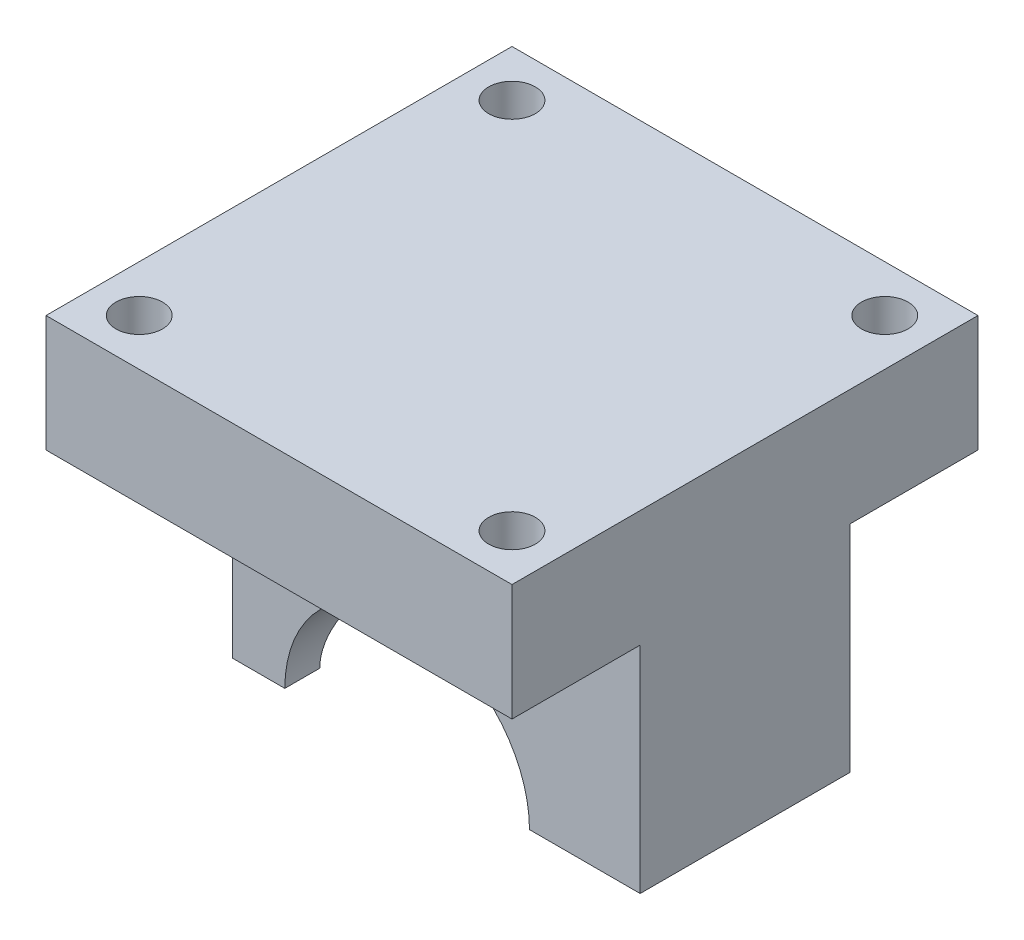
ISO-10303-21;
HEADER;
FILE_DESCRIPTION(('STEP AP214'),'2;1');
FILE_NAME('part.step','',(''),(''),'','','');
FILE_SCHEMA(('AUTOMOTIVE_DESIGN { 1 0 10303 214 1 1 1 1 }'));
ENDSEC;
DATA;
#1=APPLICATION_CONTEXT('core data for automotive mechanical design processes');
#2=APPLICATION_PROTOCOL_DEFINITION('international standard','automotive_design',2000,#1);
#3=PRODUCT_CONTEXT('',#1,'mechanical');
#4=PRODUCT('Part','Part','',(#3));
#5=PRODUCT_RELATED_PRODUCT_CATEGORY('part','',(#4));
#6=PRODUCT_DEFINITION_FORMATION('','',#4);
#7=PRODUCT_DEFINITION_CONTEXT('part definition',#1,'design');
#8=PRODUCT_DEFINITION('design','',#6,#7);
#9=PRODUCT_DEFINITION_SHAPE('','',#8);
#10=(LENGTH_UNIT() NAMED_UNIT(*) SI_UNIT(.MILLI.,.METRE.));
#11=(NAMED_UNIT(*) PLANE_ANGLE_UNIT() SI_UNIT($,.RADIAN.));
#12=(NAMED_UNIT(*) SI_UNIT($,.STERADIAN.) SOLID_ANGLE_UNIT());
#13=UNCERTAINTY_MEASURE_WITH_UNIT(LENGTH_MEASURE(1.E-05),#10,'distance_accuracy_value','');
#14=(GEOMETRIC_REPRESENTATION_CONTEXT(3) GLOBAL_UNCERTAINTY_ASSIGNED_CONTEXT((#13)) GLOBAL_UNIT_ASSIGNED_CONTEXT((#10,
#11,#12)) REPRESENTATION_CONTEXT('',''));
#15=CARTESIAN_POINT('',(0.,0.,0.));
#16=DIRECTION('',(0.,0.,1.));
#17=DIRECTION('',(1.,0.,0.));
#18=AXIS2_PLACEMENT_3D('',#15,#16,#17);
#19=CARTESIAN_POINT('',(0.,0.,0.));
#20=DIRECTION('',(0.,-1.,0.));
#21=DIRECTION('',(0.,0.,-1.));
#22=AXIS2_PLACEMENT_3D('',#19,#20,#21);
#23=PLANE('',#22);
#24=DIRECTION('',(0.,0.,1.));
#25=VECTOR('',#24,1.);
#26=CARTESIAN_POINT('',(-15.,0.,9.));
#27=LINE('',#26,#25);
#28=CARTESIAN_POINT('',(-15.,0.,6.));
#29=VERTEX_POINT('',#28);
#30=CARTESIAN_POINT('',(-15.,0.,9.));
#31=VERTEX_POINT('',#30);
#32=EDGE_CURVE('E228',#29,#31,#27,.T.);
#33=ORIENTED_EDGE('',*,*,#32,.F.);
#34=DIRECTION('',(-1.,0.,0.));
#35=VECTOR('',#34,1.);
#36=CARTESIAN_POINT('',(20.001,0.,6.));
#37=LINE('',#36,#35);
#38=CARTESIAN_POINT('',(-10.5,0.,6.));
#39=VERTEX_POINT('',#38);
#40=EDGE_CURVE('E232',#29,#39,#37,.F.);
#41=ORIENTED_EDGE('',*,*,#40,.T.);
#42=DIRECTION('',(0.,0.,1.));
#43=VECTOR('',#42,1.);
#44=CARTESIAN_POINT('',(-10.5,0.,-9.001));
#45=LINE('',#44,#43);
#46=CARTESIAN_POINT('',(-10.5,0.,9.));
#47=VERTEX_POINT('',#46);
#48=EDGE_CURVE('E241',#39,#47,#45,.T.);
#49=ORIENTED_EDGE('',*,*,#48,.T.);
#50=DIRECTION('',(1.,0.,0.));
#51=VECTOR('',#50,1.);
#52=CARTESIAN_POINT('',(-20.,0.,9.));
#53=LINE('',#52,#51);
#54=EDGE_CURVE('E209',#31,#47,#53,.T.);
#55=ORIENTED_EDGE('',*,*,#54,.F.);
#56=EDGE_LOOP('',(#33,#41,#49,#55));
#57=FACE_BOUND('',#56,.T.);
#58=ADVANCED_FACE('F33',(#57),#23,.T.);
#59=DIRECTION('',(0.,0.,1.));
#60=VECTOR('',#59,1.);
#61=CARTESIAN_POINT('',(10.5,0.,-9.001));
#62=LINE('',#61,#60);
#63=CARTESIAN_POINT('',(10.5,0.,9.));
#64=VERTEX_POINT('',#63);
#65=CARTESIAN_POINT('',(10.5,0.,-9.));
#66=VERTEX_POINT('',#65);
#67=EDGE_CURVE('E303',#64,#66,#62,.F.);
#68=ORIENTED_EDGE('',*,*,#67,.T.);
#69=DIRECTION('',(-1.,0.,0.));
#70=VECTOR('',#69,1.);
#71=CARTESIAN_POINT('',(-20.,0.,-9.));
#72=LINE('',#71,#70);
#73=CARTESIAN_POINT('',(20.,0.,-9.));
#74=VERTEX_POINT('',#73);
#75=EDGE_CURVE('E198',#74,#66,#72,.T.);
#76=ORIENTED_EDGE('',*,*,#75,.F.);
#77=DIRECTION('',(0.,0.,-1.));
#78=VECTOR('',#77,1.);
#79=CARTESIAN_POINT('',(20.,0.,9.));
#80=LINE('',#79,#78);
#81=CARTESIAN_POINT('',(20.,0.,9.));
#82=VERTEX_POINT('',#81);
#83=EDGE_CURVE('E189',#82,#74,#80,.T.);
#84=ORIENTED_EDGE('',*,*,#83,.F.);
#85=EDGE_CURVE('E196',#64,#82,#53,.T.);
#86=ORIENTED_EDGE('',*,*,#85,.F.);
#87=EDGE_LOOP('',(#68,#76,#84,#86));
#88=FACE_BOUND('',#87,.T.);
#89=ADVANCED_FACE('F195',(#88),#23,.T.);
#90=CARTESIAN_POINT('',(20.,18.47,9.));
#91=DIRECTION('',(-1.,0.,0.));
#92=DIRECTION('',(0.,0.,1.));
#93=AXIS2_PLACEMENT_3D('',#90,#91,#92);
#94=PLANE('',#93);
#95=ORIENTED_EDGE('',*,*,#83,.T.);
#96=DIRECTION('',(0.,-1.,0.));
#97=VECTOR('',#96,1.);
#98=CARTESIAN_POINT('',(20.,18.47,-9.));
#99=LINE('',#98,#97);
#100=CARTESIAN_POINT('',(20.,18.47,-9.));
#101=VERTEX_POINT('',#100);
#102=EDGE_CURVE('E11',#101,#74,#99,.T.);
#103=ORIENTED_EDGE('',*,*,#102,.F.);
#104=DIRECTION('',(0.,0.,-1.));
#105=VECTOR('',#104,1.);
#106=CARTESIAN_POINT('',(20.,18.47,20.));
#107=LINE('',#106,#105);
#108=CARTESIAN_POINT('',(20.,18.47,-20.));
#109=VERTEX_POINT('',#108);
#110=EDGE_CURVE('E148',#101,#109,#107,.T.);
#111=ORIENTED_EDGE('',*,*,#110,.T.);
#112=DIRECTION('',(0.,-1.,0.));
#113=VECTOR('',#112,1.);
#114=CARTESIAN_POINT('',(20.,28.47,-20.));
#115=LINE('',#114,#113);
#116=CARTESIAN_POINT('',(20.,28.47,-20.));
#117=VERTEX_POINT('',#116);
#118=EDGE_CURVE('E128',#117,#109,#115,.T.);
#119=ORIENTED_EDGE('',*,*,#118,.F.);
#120=DIRECTION('',(0.,0.,-1.));
#121=VECTOR('',#120,1.);
#122=CARTESIAN_POINT('',(20.,28.47,20.));
#123=LINE('',#122,#121);
#124=CARTESIAN_POINT('',(20.,28.47,20.));
#125=VERTEX_POINT('',#124);
#126=EDGE_CURVE('E134',#125,#117,#123,.T.);
#127=ORIENTED_EDGE('',*,*,#126,.F.);
#128=DIRECTION('',(0.,-1.,0.));
#129=VECTOR('',#128,1.);
#130=CARTESIAN_POINT('',(20.,28.47,20.));
#131=LINE('',#130,#129);
#132=CARTESIAN_POINT('',(20.,18.47,20.));
#133=VERTEX_POINT('',#132);
#134=EDGE_CURVE('E172',#125,#133,#131,.T.);
#135=ORIENTED_EDGE('',*,*,#134,.T.);
#136=CARTESIAN_POINT('',(20.,18.47,9.));
#137=VERTEX_POINT('',#136);
#138=EDGE_CURVE('E158',#133,#137,#107,.T.);
#139=ORIENTED_EDGE('',*,*,#138,.T.);
#140=DIRECTION('',(0.,-1.,0.));
#141=VECTOR('',#140,1.);
#142=CARTESIAN_POINT('',(20.,18.47,9.));
#143=LINE('',#142,#141);
#144=EDGE_CURVE('E42',#137,#82,#143,.T.);
#145=ORIENTED_EDGE('',*,*,#144,.T.);
#146=EDGE_LOOP('',(#95,#103,#111,#119,#127,#135,#139,#145));
#147=FACE_BOUND('',#146,.T.);
#148=ADVANCED_FACE('F35',(#147),#94,.F.);
#149=CARTESIAN_POINT('',(-20.,18.47,-9.));
#150=DIRECTION('',(0.,0.,1.));
#151=DIRECTION('',(1.,0.,0.));
#152=AXIS2_PLACEMENT_3D('',#149,#150,#151);
#153=PLANE('',#152);
#154=CARTESIAN_POINT('',(-10.5,0.,-9.));
#155=VERTEX_POINT('',#154);
#156=CARTESIAN_POINT('',(-15.,0.,-9.));
#157=VERTEX_POINT('',#156);
#158=EDGE_CURVE('E199',#155,#157,#72,.T.);
#159=ORIENTED_EDGE('',*,*,#158,.T.);
#160=DIRECTION('',(0.,-1.,0.));
#161=VECTOR('',#160,1.);
#162=CARTESIAN_POINT('',(-15.,18.471,-9.));
#163=LINE('',#162,#161);
#164=CARTESIAN_POINT('',(-15.,18.47,-9.));
#165=VERTEX_POINT('',#164);
#166=EDGE_CURVE('E221',#165,#157,#163,.T.);
#167=ORIENTED_EDGE('',*,*,#166,.F.);
#168=DIRECTION('',(-1.,0.,0.));
#169=VECTOR('',#168,1.);
#170=CARTESIAN_POINT('',(-20.,18.47,-9.));
#171=LINE('',#170,#169);
#172=EDGE_CURVE('E210',#101,#165,#171,.T.);
#173=ORIENTED_EDGE('',*,*,#172,.F.);
#174=ORIENTED_EDGE('',*,*,#102,.T.);
#175=ORIENTED_EDGE('',*,*,#75,.T.);
#176=CARTESIAN_POINT('',(0.,0.,-9.));
#177=DIRECTION('',(0.,0.,1.));
#178=DIRECTION('',(1.,0.,0.));
#179=AXIS2_PLACEMENT_3D('',#176,#177,#178);
#180=CIRCLE('',#179,10.5);
#181=EDGE_CURVE('E200',#155,#66,#180,.F.);
#182=ORIENTED_EDGE('',*,*,#181,.F.);
#183=EDGE_LOOP('',(#159,#167,#173,#174,#175,#182));
#184=FACE_BOUND('',#183,.T.);
#185=ADVANCED_FACE('F220',(#184),#153,.F.);
#186=CARTESIAN_POINT('',(-20.,18.47,9.));
#187=DIRECTION('',(0.,0.,-1.));
#188=DIRECTION('',(-1.,0.,0.));
#189=AXIS2_PLACEMENT_3D('',#186,#187,#188);
#190=PLANE('',#189);
#191=DIRECTION('',(1.,0.,0.));
#192=VECTOR('',#191,1.);
#193=CARTESIAN_POINT('',(-20.,18.47,9.));
#194=LINE('',#193,#192);
#195=CARTESIAN_POINT('',(-15.,18.47,9.));
#196=VERTEX_POINT('',#195);
#197=EDGE_CURVE('E186',#196,#137,#194,.T.);
#198=ORIENTED_EDGE('',*,*,#197,.F.);
#199=DIRECTION('',(0.,-1.,0.));
#200=VECTOR('',#199,1.);
#201=CARTESIAN_POINT('',(-15.,18.471,9.));
#202=LINE('',#201,#200);
#203=EDGE_CURVE('E224',#196,#31,#202,.T.);
#204=ORIENTED_EDGE('',*,*,#203,.T.);
#205=ORIENTED_EDGE('',*,*,#54,.T.);
#206=CARTESIAN_POINT('',(0.,0.,9.));
#207=DIRECTION('',(0.,0.,1.));
#208=DIRECTION('',(1.,0.,0.));
#209=AXIS2_PLACEMENT_3D('',#206,#207,#208);
#210=CIRCLE('',#209,10.5);
#211=EDGE_CURVE('E204',#64,#47,#210,.T.);
#212=ORIENTED_EDGE('',*,*,#211,.F.);
#213=ORIENTED_EDGE('',*,*,#85,.T.);
#214=ORIENTED_EDGE('',*,*,#144,.F.);
#215=EDGE_LOOP('',(#198,#204,#205,#212,#213,#214));
#216=FACE_BOUND('',#215,.T.);
#217=ADVANCED_FACE('F295',(#216),#190,.F.);
#218=CARTESIAN_POINT('',(-15.,0.,-6.));
#219=VERTEX_POINT('',#218);
#220=EDGE_CURVE('E49',#157,#219,#27,.T.);
#221=ORIENTED_EDGE('',*,*,#220,.F.);
#222=ORIENTED_EDGE('',*,*,#158,.F.);
#223=CARTESIAN_POINT('',(-10.5,0.,-6.));
#224=VERTEX_POINT('',#223);
#225=EDGE_CURVE('E242',#155,#224,#45,.T.);
#226=ORIENTED_EDGE('',*,*,#225,.T.);
#227=DIRECTION('',(-1.,0.,0.));
#228=VECTOR('',#227,1.);
#229=CARTESIAN_POINT('',(20.001,0.,-6.));
#230=LINE('',#229,#228);
#231=EDGE_CURVE('E56',#224,#219,#230,.T.);
#232=ORIENTED_EDGE('',*,*,#231,.T.);
#233=EDGE_LOOP('',(#221,#222,#226,#232));
#234=FACE_BOUND('',#233,.T.);
#235=ADVANCED_FACE('F287',(#234),#23,.T.);
#236=CARTESIAN_POINT('',(0.,0.,-9.001));
#237=DIRECTION('',(0.,0.,1.));
#238=DIRECTION('',(1.,0.,0.));
#239=AXIS2_PLACEMENT_3D('',#236,#237,#238);
#240=CYLINDRICAL_SURFACE('',#239,10.5);
#241=ORIENTED_EDGE('',*,*,#48,.F.);
#242=CARTESIAN_POINT('',(-10.5,0.,-6.));
#243=CARTESIAN_POINT('',(-10.5000312323171,0.155502925143123,-6.00002868326071));
#244=CARTESIAN_POINT('',(-10.4965467619336,0.310989459605455,-5.9939560372494));
#245=CARTESIAN_POINT('',(-10.4827773380282,0.620654508223242,-5.96982428552888));
#246=CARTESIAN_POINT('',(-10.472495621128,0.774833609562622,-5.95177088463915));
#247=CARTESIAN_POINT('',(-10.4454333996789,1.07995629913026,-5.9040190415042));
#248=CARTESIAN_POINT('',(-10.4286872742641,1.23091261863768,-5.87438219231843));
#249=CARTESIAN_POINT('',(-10.3891154411449,1.52935731424097,-5.80384155522881));
#250=CARTESIAN_POINT('',(-10.3662892642791,1.67684542175931,-5.76293689784672));
#251=CARTESIAN_POINT('',(-10.3151366966868,1.96713870302777,-5.67040818495836));
#252=CARTESIAN_POINT('',(-10.2868201926486,2.10995176296317,-5.6188033862729));
#253=CARTESIAN_POINT('',(-10.2252973118242,2.39038550341413,-5.50535790834433));
#254=CARTESIAN_POINT('',(-10.1920890817453,2.5280041910418,-5.44351334853124));
#255=CARTESIAN_POINT('',(-10.0861193920345,2.93216830627208,-5.24334940394797));
#256=CARTESIAN_POINT('',(-10.0070202984068,3.1899816733811,-5.09041269971699));
#257=CARTESIAN_POINT('',(-9.83222574184396,3.69512383646307,-4.73790322568543));
#258=CARTESIAN_POINT('',(-9.7357476069095,3.94038133658734,-4.53577592438749));
#259=CARTESIAN_POINT('',(-9.53892202787594,4.39551157162937,-4.09630897576221));
#260=CARTESIAN_POINT('',(-9.43857081219306,4.60534868869554,-3.85893433002525));
#261=CARTESIAN_POINT('',(-9.23241829705254,5.00686738849591,-3.32482825851804));
#262=CARTESIAN_POINT('',(-9.1272116275037,5.19409089283758,-3.02444886551071));
#263=CARTESIAN_POINT('',(-8.98479353337835,5.43435387829326,-2.54937929896771));
#264=CARTESIAN_POINT('',(-8.93989050301715,5.50767329511113,-2.38695977929524));
#265=CARTESIAN_POINT('',(-8.85696777871921,5.64005451406595,-2.05468008989987));
#266=CARTESIAN_POINT('',(-8.81894582704675,5.69912099483071,-1.88482238350506));
#267=CARTESIAN_POINT('',(-8.75900479298559,5.79069350293105,-1.57722146865764));
#268=CARTESIAN_POINT('',(-8.73538420623737,5.82618464662098,-1.44068900951035));
#269=CARTESIAN_POINT('',(-8.69411873649479,5.88758618847257,-1.16460806153307));
#270=CARTESIAN_POINT('',(-8.67647258151584,5.91349862609376,-1.02506022143096));
#271=CARTESIAN_POINT('',(-8.64776851771148,5.95539645016538,-0.743930927036742));
#272=CARTESIAN_POINT('',(-8.63670492774402,5.97139039736415,-0.602351334677315));
#273=CARTESIAN_POINT('',(-8.62154261003826,5.99326137071358,-0.318033404753159));
#274=CARTESIAN_POINT('',(-8.61744402127387,5.99913819499552,-0.175295044124418));
#275=CARTESIAN_POINT('',(-8.61636587961779,6.00068664959584,0.110458829006182));
#276=CARTESIAN_POINT('',(-8.61939601081516,5.99634439769363,0.253474454509471));
#277=CARTESIAN_POINT('',(-8.63248014050462,5.97749246711862,0.538504544520632));
#278=CARTESIAN_POINT('',(-8.64253416674081,5.96298274828477,0.680519005071708));
#279=CARTESIAN_POINT('',(-8.66930589933352,5.92399304566501,0.962589777827786));
#280=CARTESIAN_POINT('',(-8.68602610500563,5.89950932230301,1.10264533518271));
#281=CARTESIAN_POINT('',(-8.72554694173816,5.84089629409534,1.37986871062944));
#282=CARTESIAN_POINT('',(-8.74835002778777,5.80676309448519,1.51703533860869));
#283=CARTESIAN_POINT('',(-8.82460229177655,5.69078084989655,1.92183102381229));
#284=CARTESIAN_POINT('',(-8.88603904603347,5.59515083407102,2.184154118654));
#285=CARTESIAN_POINT('',(-9.02357537045335,5.37050972239288,2.6896830519722));
#286=CARTESIAN_POINT('',(-9.09968079043222,5.24148530189929,2.93288120882267));
#287=CARTESIAN_POINT('',(-9.27278901621917,4.92970041368248,3.43491779845721));
#288=CARTESIAN_POINT('',(-9.37118647785558,4.74164295800828,3.69002155625297));
#289=CARTESIAN_POINT('',(-9.51963407244217,4.43167932701314,4.04786482987679));
#290=CARTESIAN_POINT('',(-9.569298391235,4.3236146907551,4.16309237053519));
#291=CARTESIAN_POINT('',(-9.66784979801288,4.09850674859315,4.38488226998758));
#292=CARTESIAN_POINT('',(-9.71673675848215,3.98146198758747,4.49144321869622));
#293=CARTESIAN_POINT('',(-9.81815731565572,3.72490802201013,4.70704547522145));
#294=CARTESIAN_POINT('',(-9.87046404907576,3.58436314547206,4.81496363613988));
#295=CARTESIAN_POINT('',(-9.97131462894593,3.29341403182272,5.01845800180585));
#296=CARTESIAN_POINT('',(-10.0198599947089,3.14301382132218,5.11403920026658));
#297=CARTESIAN_POINT('',(-10.111798359052,2.83330042558111,5.29190468197646));
#298=CARTESIAN_POINT('',(-10.1551977262947,2.67399862404779,5.37420544755071));
#299=CARTESIAN_POINT('',(-10.2356204791023,2.34740884183261,5.52466913121936));
#300=CARTESIAN_POINT('',(-10.272647735488,2.18012578891822,5.59284063749481));
#301=CARTESIAN_POINT('',(-10.3368535242973,1.85083055260308,5.70988272169392));
#302=CARTESIAN_POINT('',(-10.364543416916,1.68928242275379,5.75977740504482));
#303=CARTESIAN_POINT('',(-10.4126648623234,1.36155617090495,5.84592739375965));
#304=CARTESIAN_POINT('',(-10.433097691071,1.19537886836698,5.88218509688455));
#305=CARTESIAN_POINT('',(-10.4662149385246,0.85857650246765,5.94072776248758));
#306=CARTESIAN_POINT('',(-10.4788444595665,0.687928538185176,5.96291375628162));
#307=CARTESIAN_POINT('',(-10.4915160033629,0.430685549197037,5.98514324040381));
#308=CARTESIAN_POINT('',(-10.4946944134647,0.344680981066985,5.99071150065149));
#309=CARTESIAN_POINT('',(-10.4989372292922,0.172455798337681,5.99814038563698));
#310=CARTESIAN_POINT('',(-10.5000015336611,0.0862351735784179,6.00000083261077));
#311=CARTESIAN_POINT('',(-10.5,0.,6.));
#312=B_SPLINE_CURVE_WITH_KNOTS('',3,(#242,#243,#244,#245,#246,#247,#248,#249,#250,#251,#252,
#253,#254,#255,#256,#257,#258,#259,#260,#261,#262,#263,#264,#265,#266,#267,#268,#269,#270,#271,
#272,#273,#274,#275,#276,#277,#278,#279,#280,#281,#282,#283,#284,#285,#286,#287,#288,#289,#290,
#291,#292,#293,#294,#295,#296,#297,#298,#299,#300,#301,#302,#303,#304,#305,#306,#307,#308,#309,
#310,#311),.UNSPECIFIED.,.F.,.F.,(4,2,2,2,2,2,2,2,2,2,2,2,2,2,2,2,2,2,2,2,2,2,2,2,2,2,2,2,2,2,2,
2,2,2,4),(0.,0.466325450821407,0.932429012825639,1.39608714609375,1.85978106747844,
2.32264762110014,2.78568999079645,3.71190164616867,4.70440865553539,5.69790783519077,
6.79948138478367,7.35013944891105,7.90061650895936,8.32928412961428,8.75786042744241,
9.18606630005451,9.61428071663408,10.0430771816857,10.4718753404744,10.9008344177125,
11.3299668811251,12.1840218241832,13.0384180689222,14.0296721281382,14.526090368468,
15.0225892169002,15.5761655870355,16.1295171749984,16.6821766273884,17.2344991654586,
17.7477562391189,18.260923025654,18.7776601070629,19.0362978380061,19.2949479685426),.UNSPECIFIED.);
#313=EDGE_CURVE('E234',#224,#39,#312,.T.);
#314=ORIENTED_EDGE('',*,*,#313,.F.);
#315=ORIENTED_EDGE('',*,*,#225,.F.);
#316=ORIENTED_EDGE('',*,*,#181,.T.);
#317=ORIENTED_EDGE('',*,*,#67,.F.);
#318=ORIENTED_EDGE('',*,*,#211,.T.);
#319=EDGE_LOOP('',(#241,#314,#315,#316,#317,#318));
#320=FACE_BOUND('',#319,.T.);
#321=ADVANCED_FACE('F294',(#320),#240,.F.);
#322=CARTESIAN_POINT('',(20.001,0.,0.));
#323=DIRECTION('',(-1.,0.,0.));
#324=DIRECTION('',(0.,0.,1.));
#325=AXIS2_PLACEMENT_3D('',#322,#323,#324);
#326=CYLINDRICAL_SURFACE('',#325,6.);
#327=ORIENTED_EDGE('',*,*,#40,.F.);
#328=CARTESIAN_POINT('',(-15.,0.,0.));
#329=DIRECTION('',(1.,0.,0.));
#330=DIRECTION('',(0.,0.,-1.));
#331=AXIS2_PLACEMENT_3D('',#328,#329,#330);
#332=CIRCLE('',#331,6.);
#333=EDGE_CURVE('E150',#219,#29,#332,.T.);
#334=ORIENTED_EDGE('',*,*,#333,.F.);
#335=ORIENTED_EDGE('',*,*,#231,.F.);
#336=ORIENTED_EDGE('',*,*,#313,.T.);
#337=EDGE_LOOP('',(#327,#334,#335,#336));
#338=FACE_BOUND('',#337,.T.);
#339=ADVANCED_FACE('F244',(#338),#326,.F.);
#340=CARTESIAN_POINT('',(-15.,18.471,9.));
#341=DIRECTION('',(1.,0.,0.));
#342=DIRECTION('',(0.,0.,-1.));
#343=AXIS2_PLACEMENT_3D('',#340,#341,#342);
#344=PLANE('',#343);
#345=DIRECTION('',(0.,0.,-1.));
#346=VECTOR('',#345,1.);
#347=CARTESIAN_POINT('',(-15.,18.47,9.));
#348=LINE('',#347,#346);
#349=EDGE_CURVE('E152',#196,#165,#348,.T.);
#350=ORIENTED_EDGE('',*,*,#349,.T.);
#351=ORIENTED_EDGE('',*,*,#166,.T.);
#352=ORIENTED_EDGE('',*,*,#220,.T.);
#353=ORIENTED_EDGE('',*,*,#333,.T.);
#354=ORIENTED_EDGE('',*,*,#32,.T.);
#355=ORIENTED_EDGE('',*,*,#203,.F.);
#356=EDGE_LOOP('',(#350,#351,#352,#353,#354,#355));
#357=FACE_BOUND('',#356,.T.);
#358=ADVANCED_FACE('F249',(#357),#344,.F.);
#359=CARTESIAN_POINT('',(-20.,28.47,-20.));
#360=DIRECTION('',(0.,0.,1.));
#361=DIRECTION('',(1.,0.,0.));
#362=AXIS2_PLACEMENT_3D('',#359,#360,#361);
#363=PLANE('',#362);
#364=DIRECTION('',(-1.,0.,0.));
#365=VECTOR('',#364,1.);
#366=CARTESIAN_POINT('',(-20.,18.47,-20.));
#367=LINE('',#366,#365);
#368=CARTESIAN_POINT('',(-20.,18.47,-20.));
#369=VERTEX_POINT('',#368);
#370=EDGE_CURVE('E162',#109,#369,#367,.T.);
#371=ORIENTED_EDGE('',*,*,#370,.T.);
#372=DIRECTION('',(0.,-1.,0.));
#373=VECTOR('',#372,1.);
#374=CARTESIAN_POINT('',(-20.,28.47,-20.));
#375=LINE('',#374,#373);
#376=CARTESIAN_POINT('',(-20.,28.47,-20.));
#377=VERTEX_POINT('',#376);
#378=EDGE_CURVE('E130',#377,#369,#375,.T.);
#379=ORIENTED_EDGE('',*,*,#378,.F.);
#380=DIRECTION('',(-1.,0.,0.));
#381=VECTOR('',#380,1.);
#382=CARTESIAN_POINT('',(-20.,28.47,-20.));
#383=LINE('',#382,#381);
#384=EDGE_CURVE('E124',#117,#377,#383,.T.);
#385=ORIENTED_EDGE('',*,*,#384,.F.);
#386=ORIENTED_EDGE('',*,*,#118,.T.);
#387=EDGE_LOOP('',(#371,#379,#385,#386));
#388=FACE_BOUND('',#387,.T.);
#389=ADVANCED_FACE('F126',(#388),#363,.F.);
#390=CARTESIAN_POINT('',(-20.,28.47,20.));
#391=DIRECTION('',(1.,0.,0.));
#392=DIRECTION('',(0.,0.,-1.));
#393=AXIS2_PLACEMENT_3D('',#390,#391,#392);
#394=PLANE('',#393);
#395=DIRECTION('',(0.,0.,1.));
#396=VECTOR('',#395,1.);
#397=CARTESIAN_POINT('',(-20.,18.47,20.));
#398=LINE('',#397,#396);
#399=CARTESIAN_POINT('',(-20.,18.47,20.));
#400=VERTEX_POINT('',#399);
#401=EDGE_CURVE('E169',#369,#400,#398,.T.);
#402=ORIENTED_EDGE('',*,*,#401,.T.);
#403=DIRECTION('',(0.,-1.,0.));
#404=VECTOR('',#403,1.);
#405=CARTESIAN_POINT('',(-20.,28.47,20.));
#406=LINE('',#405,#404);
#407=CARTESIAN_POINT('',(-20.,28.47,20.));
#408=VERTEX_POINT('',#407);
#409=EDGE_CURVE('E154',#408,#400,#406,.T.);
#410=ORIENTED_EDGE('',*,*,#409,.F.);
#411=DIRECTION('',(0.,0.,1.));
#412=VECTOR('',#411,1.);
#413=CARTESIAN_POINT('',(-20.,28.47,20.));
#414=LINE('',#413,#412);
#415=EDGE_CURVE('E133',#377,#408,#414,.T.);
#416=ORIENTED_EDGE('',*,*,#415,.F.);
#417=ORIENTED_EDGE('',*,*,#378,.T.);
#418=EDGE_LOOP('',(#402,#410,#416,#417));
#419=FACE_BOUND('',#418,.T.);
#420=ADVANCED_FACE('F254',(#419),#394,.F.);
#421=CARTESIAN_POINT('',(-20.,28.47,20.));
#422=DIRECTION('',(0.,0.,-1.));
#423=DIRECTION('',(-1.,0.,0.));
#424=AXIS2_PLACEMENT_3D('',#421,#422,#423);
#425=PLANE('',#424);
#426=DIRECTION('',(1.,0.,0.));
#427=VECTOR('',#426,1.);
#428=CARTESIAN_POINT('',(-20.,18.47,20.));
#429=LINE('',#428,#427);
#430=EDGE_CURVE('E143',#400,#133,#429,.T.);
#431=ORIENTED_EDGE('',*,*,#430,.T.);
#432=ORIENTED_EDGE('',*,*,#134,.F.);
#433=DIRECTION('',(1.,0.,0.));
#434=VECTOR('',#433,1.);
#435=CARTESIAN_POINT('',(-20.,28.47,20.));
#436=LINE('',#435,#434);
#437=EDGE_CURVE('E139',#408,#125,#436,.T.);
#438=ORIENTED_EDGE('',*,*,#437,.F.);
#439=ORIENTED_EDGE('',*,*,#409,.T.);
#440=EDGE_LOOP('',(#431,#432,#438,#439));
#441=FACE_BOUND('',#440,.T.);
#442=ADVANCED_FACE('F177',(#441),#425,.F.);
#443=CARTESIAN_POINT('',(0.,28.47,0.));
#444=DIRECTION('',(0.,-1.,0.));
#445=DIRECTION('',(0.,0.,-1.));
#446=AXIS2_PLACEMENT_3D('',#443,#444,#445);
#447=PLANE('',#446);
#448=CARTESIAN_POINT('',(-15.9999999999997,28.47,-16.0000000000002));
#449=DIRECTION('',(0.,-1.,0.));
#450=DIRECTION('',(0.,0.,-1.));
#451=AXIS2_PLACEMENT_3D('',#448,#449,#450);
#452=CIRCLE('',#451,2.);
#453=CARTESIAN_POINT('',(-15.9999999999997,28.47,-18.0000000000002));
#454=VERTEX_POINT('',#453);
#455=EDGE_CURVE('E424',#454,#454,#452,.F.);
#456=ORIENTED_EDGE('',*,*,#455,.F.);
#457=EDGE_LOOP('',(#456));
#458=FACE_BOUND('',#457,.T.);
#459=CARTESIAN_POINT('',(-16.,28.47,15.9999999999998));
#460=DIRECTION('',(0.,-1.,0.));
#461=DIRECTION('',(0.,0.,-1.));
#462=AXIS2_PLACEMENT_3D('',#459,#460,#461);
#463=CIRCLE('',#462,2.);
#464=CARTESIAN_POINT('',(-16.,28.47,13.9999999999998));
#465=VERTEX_POINT('',#464);
#466=EDGE_CURVE('E428',#465,#465,#463,.F.);
#467=ORIENTED_EDGE('',*,*,#466,.F.);
#468=EDGE_LOOP('',(#467));
#469=FACE_BOUND('',#468,.T.);
#470=CARTESIAN_POINT('',(16.0000000000003,28.47,-16.));
#471=DIRECTION('',(0.,-1.,0.));
#472=DIRECTION('',(0.,0.,-1.));
#473=AXIS2_PLACEMENT_3D('',#470,#471,#472);
#474=CIRCLE('',#473,2.);
#475=CARTESIAN_POINT('',(16.0000000000003,28.47,-18.));
#476=VERTEX_POINT('',#475);
#477=EDGE_CURVE('E437',#476,#476,#474,.F.);
#478=ORIENTED_EDGE('',*,*,#477,.F.);
#479=EDGE_LOOP('',(#478));
#480=FACE_BOUND('',#479,.T.);
#481=CARTESIAN_POINT('',(16.,28.47,16.));
#482=DIRECTION('',(0.,-1.,0.));
#483=DIRECTION('',(0.,0.,-1.));
#484=AXIS2_PLACEMENT_3D('',#481,#482,#483);
#485=CIRCLE('',#484,2.);
#486=CARTESIAN_POINT('',(16.,28.47,14.));
#487=VERTEX_POINT('',#486);
#488=EDGE_CURVE('E443',#487,#487,#485,.F.);
#489=ORIENTED_EDGE('',*,*,#488,.F.);
#490=EDGE_LOOP('',(#489));
#491=FACE_BOUND('',#490,.T.);
#492=ORIENTED_EDGE('',*,*,#126,.T.);
#493=ORIENTED_EDGE('',*,*,#384,.T.);
#494=ORIENTED_EDGE('',*,*,#415,.T.);
#495=ORIENTED_EDGE('',*,*,#437,.T.);
#496=EDGE_LOOP('',(#492,#493,#494,#495));
#497=FACE_BOUND('',#496,.T.);
#498=ADVANCED_FACE('F137',(#458,#469,#480,#491,#497),#447,.F.);
#499=CARTESIAN_POINT('',(0.,18.47,0.));
#500=DIRECTION('',(0.,-1.,0.));
#501=DIRECTION('',(0.,0.,-1.));
#502=AXIS2_PLACEMENT_3D('',#499,#500,#501);
#503=PLANE('',#502);
#504=CARTESIAN_POINT('',(-15.9999999999997,18.47,-16.0000000000002));
#505=DIRECTION('',(0.,-1.,0.));
#506=DIRECTION('',(0.,0.,-1.));
#507=AXIS2_PLACEMENT_3D('',#504,#505,#506);
#508=CIRCLE('',#507,2.);
#509=CARTESIAN_POINT('',(-15.9999999999997,18.47,-18.0000000000002));
#510=VERTEX_POINT('',#509);
#511=EDGE_CURVE('E421',#510,#510,#508,.T.);
#512=ORIENTED_EDGE('',*,*,#511,.F.);
#513=EDGE_LOOP('',(#512));
#514=FACE_BOUND('',#513,.T.);
#515=CARTESIAN_POINT('',(-16.,18.47,15.9999999999998));
#516=DIRECTION('',(0.,-1.,0.));
#517=DIRECTION('',(0.,0.,-1.));
#518=AXIS2_PLACEMENT_3D('',#515,#516,#517);
#519=CIRCLE('',#518,2.);
#520=CARTESIAN_POINT('',(-16.,18.47,13.9999999999998));
#521=VERTEX_POINT('',#520);
#522=EDGE_CURVE('E425',#521,#521,#519,.T.);
#523=ORIENTED_EDGE('',*,*,#522,.F.);
#524=EDGE_LOOP('',(#523));
#525=FACE_BOUND('',#524,.T.);
#526=CARTESIAN_POINT('',(16.0000000000003,18.47,-16.));
#527=DIRECTION('',(0.,-1.,0.));
#528=DIRECTION('',(0.,0.,-1.));
#529=AXIS2_PLACEMENT_3D('',#526,#527,#528);
#530=CIRCLE('',#529,2.);
#531=CARTESIAN_POINT('',(16.0000000000003,18.47,-18.));
#532=VERTEX_POINT('',#531);
#533=EDGE_CURVE('E434',#532,#532,#530,.T.);
#534=ORIENTED_EDGE('',*,*,#533,.F.);
#535=EDGE_LOOP('',(#534));
#536=FACE_BOUND('',#535,.T.);
#537=CARTESIAN_POINT('',(16.,18.47,16.));
#538=DIRECTION('',(0.,-1.,0.));
#539=DIRECTION('',(0.,0.,-1.));
#540=AXIS2_PLACEMENT_3D('',#537,#538,#539);
#541=CIRCLE('',#540,2.);
#542=CARTESIAN_POINT('',(16.,18.47,14.));
#543=VERTEX_POINT('',#542);
#544=EDGE_CURVE('E440',#543,#543,#541,.T.);
#545=ORIENTED_EDGE('',*,*,#544,.F.);
#546=EDGE_LOOP('',(#545));
#547=FACE_BOUND('',#546,.T.);
#548=ORIENTED_EDGE('',*,*,#110,.F.);
#549=ORIENTED_EDGE('',*,*,#172,.T.);
#550=ORIENTED_EDGE('',*,*,#349,.F.);
#551=ORIENTED_EDGE('',*,*,#197,.T.);
#552=ORIENTED_EDGE('',*,*,#138,.F.);
#553=ORIENTED_EDGE('',*,*,#430,.F.);
#554=ORIENTED_EDGE('',*,*,#401,.F.);
#555=ORIENTED_EDGE('',*,*,#370,.F.);
#556=EDGE_LOOP('',(#548,#549,#550,#551,#552,#553,#554,#555));
#557=FACE_BOUND('',#556,.T.);
#558=ADVANCED_FACE('F182',(#514,#525,#536,#547,#557),#503,.T.);
#559=CARTESIAN_POINT('',(16.,28.471,16.));
#560=DIRECTION('',(0.,-1.,0.));
#561=DIRECTION('',(0.,0.,-1.));
#562=AXIS2_PLACEMENT_3D('',#559,#560,#561);
#563=CYLINDRICAL_SURFACE('',#562,2.);
#564=ORIENTED_EDGE('',*,*,#544,.T.);
#565=EDGE_LOOP('',(#564));
#566=FACE_BOUND('',#565,.T.);
#567=ORIENTED_EDGE('',*,*,#488,.T.);
#568=EDGE_LOOP('',(#567));
#569=FACE_BOUND('',#568,.T.);
#570=ADVANCED_FACE('F261',(#566,#569),#563,.F.);
#571=CARTESIAN_POINT('',(16.0000000000003,28.471,-16.));
#572=DIRECTION('',(0.,-1.,0.));
#573=DIRECTION('',(0.,0.,-1.));
#574=AXIS2_PLACEMENT_3D('',#571,#572,#573);
#575=CYLINDRICAL_SURFACE('',#574,2.);
#576=ORIENTED_EDGE('',*,*,#533,.T.);
#577=EDGE_LOOP('',(#576));
#578=FACE_BOUND('',#577,.T.);
#579=ORIENTED_EDGE('',*,*,#477,.T.);
#580=EDGE_LOOP('',(#579));
#581=FACE_BOUND('',#580,.T.);
#582=ADVANCED_FACE('F268',(#578,#581),#575,.F.);
#583=CARTESIAN_POINT('',(-16.,28.471,15.9999999999998));
#584=DIRECTION('',(0.,-1.,0.));
#585=DIRECTION('',(0.,0.,-1.));
#586=AXIS2_PLACEMENT_3D('',#583,#584,#585);
#587=CYLINDRICAL_SURFACE('',#586,2.);
#588=ORIENTED_EDGE('',*,*,#522,.T.);
#589=EDGE_LOOP('',(#588));
#590=FACE_BOUND('',#589,.T.);
#591=ORIENTED_EDGE('',*,*,#466,.T.);
#592=EDGE_LOOP('',(#591));
#593=FACE_BOUND('',#592,.T.);
#594=ADVANCED_FACE('F272',(#590,#593),#587,.F.);
#595=CARTESIAN_POINT('',(-15.9999999999997,28.471,-16.0000000000002));
#596=DIRECTION('',(0.,-1.,0.));
#597=DIRECTION('',(0.,0.,-1.));
#598=AXIS2_PLACEMENT_3D('',#595,#596,#597);
#599=CYLINDRICAL_SURFACE('',#598,2.);
#600=ORIENTED_EDGE('',*,*,#511,.T.);
#601=EDGE_LOOP('',(#600));
#602=FACE_BOUND('',#601,.T.);
#603=ORIENTED_EDGE('',*,*,#455,.T.);
#604=EDGE_LOOP('',(#603));
#605=FACE_BOUND('',#604,.T.);
#606=ADVANCED_FACE('F276',(#602,#605),#599,.F.);
#607=CLOSED_SHELL('',(#58,#89,#148,#185,#217,#235,#321,#339,#358,#389,#420,#442,#498,#558,#570,
#582,#594,#606));
#608=MANIFOLD_SOLID_BREP('B2',#607);
#609=ADVANCED_BREP_SHAPE_REPRESENTATION('',(#18,#608),#14);
#610=SHAPE_DEFINITION_REPRESENTATION(#9,#609);
ENDSEC;
END-ISO-10303-21;
